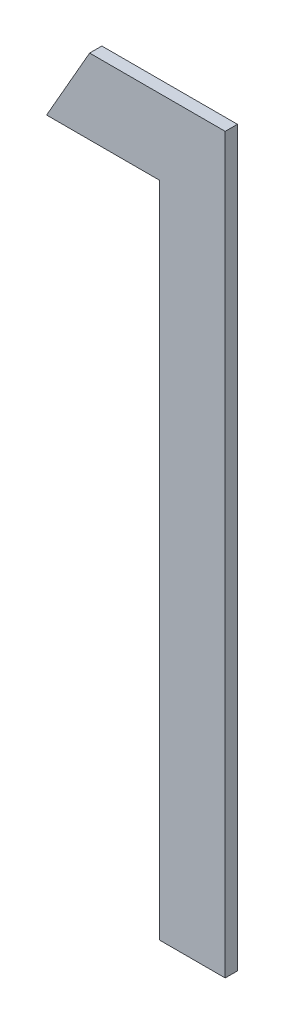
ISO-10303-21;
HEADER;
FILE_DESCRIPTION(('STEP AP214'),'2;1');
FILE_NAME('part.step','',(''),(''),'','','');
FILE_SCHEMA(('AUTOMOTIVE_DESIGN { 1 0 10303 214 1 1 1 1 }'));
ENDSEC;
DATA;
#1=APPLICATION_CONTEXT('core data for automotive mechanical design processes');
#2=APPLICATION_PROTOCOL_DEFINITION('international standard','automotive_design',2000,#1);
#3=PRODUCT_CONTEXT('',#1,'mechanical');
#4=PRODUCT('Part','Part','',(#3));
#5=PRODUCT_RELATED_PRODUCT_CATEGORY('part','',(#4));
#6=PRODUCT_DEFINITION_FORMATION('','',#4);
#7=PRODUCT_DEFINITION_CONTEXT('part definition',#1,'design');
#8=PRODUCT_DEFINITION('design','',#6,#7);
#9=PRODUCT_DEFINITION_SHAPE('','',#8);
#10=(LENGTH_UNIT() NAMED_UNIT(*) SI_UNIT(.MILLI.,.METRE.));
#11=(NAMED_UNIT(*) PLANE_ANGLE_UNIT() SI_UNIT($,.RADIAN.));
#12=(NAMED_UNIT(*) SI_UNIT($,.STERADIAN.) SOLID_ANGLE_UNIT());
#13=UNCERTAINTY_MEASURE_WITH_UNIT(LENGTH_MEASURE(1.E-05),#10,'distance_accuracy_value','');
#14=(GEOMETRIC_REPRESENTATION_CONTEXT(3) GLOBAL_UNCERTAINTY_ASSIGNED_CONTEXT((#13)) GLOBAL_UNIT_ASSIGNED_CONTEXT((#10,
#11,#12)) REPRESENTATION_CONTEXT('',''));
#15=CARTESIAN_POINT('',(0.,0.,0.));
#16=DIRECTION('',(0.,0.,1.));
#17=DIRECTION('',(1.,0.,0.));
#18=AXIS2_PLACEMENT_3D('',#15,#16,#17);
#19=CARTESIAN_POINT('',(1.28230769230769,0.24390475768074,0.551));
#20=DIRECTION('',(-0.86793001385971,0.496686511837681,0.));
#21=DIRECTION('',(-0.496686511837681,-0.86793001385971,0.));
#22=AXIS2_PLACEMENT_3D('',#19,#20,#21);
#23=PLANE('',#22);
#24=DIRECTION('',(0.496686511837677,0.867930013859713,0.));
#25=VECTOR('',#24,1.);
#26=CARTESIAN_POINT('',(1.28230769230769,0.24390475768074,0.55));
#27=LINE('',#26,#25);
#28=CARTESIAN_POINT('',(1.28230769230769,0.24390475768074,0.55));
#29=VERTEX_POINT('',#28);
#30=CARTESIAN_POINT('',(1.28582932692308,0.250058603834586,0.55));
#31=VERTEX_POINT('',#30);
#32=EDGE_CURVE('E11',#29,#31,#27,.T.);
#33=ORIENTED_EDGE('',*,*,#32,.F.);
#34=DIRECTION('',(0.,0.,-1.));
#35=VECTOR('',#34,1.);
#36=CARTESIAN_POINT('',(1.28230769230769,0.24390475768074,0.551));
#37=LINE('',#36,#35);
#38=CARTESIAN_POINT('',(1.28230769230769,0.24390475768074,0.551));
#39=VERTEX_POINT('',#38);
#40=EDGE_CURVE('E119',#39,#29,#37,.T.);
#41=ORIENTED_EDGE('',*,*,#40,.F.);
#42=DIRECTION('',(0.496686511837677,0.867930013859713,0.));
#43=VECTOR('',#42,1.);
#44=CARTESIAN_POINT('',(1.28230769230769,0.24390475768074,0.551));
#45=LINE('',#44,#43);
#46=CARTESIAN_POINT('',(1.28582932692308,0.250058603834586,0.551));
#47=VERTEX_POINT('',#46);
#48=EDGE_CURVE('E112',#39,#47,#45,.T.);
#49=ORIENTED_EDGE('',*,*,#48,.T.);
#50=DIRECTION('',(0.,0.,-1.));
#51=VECTOR('',#50,1.);
#52=CARTESIAN_POINT('',(1.28582932692308,0.250058603834586,0.551));
#53=LINE('',#52,#51);
#54=EDGE_CURVE('E85',#47,#31,#53,.T.);
#55=ORIENTED_EDGE('',*,*,#54,.T.);
#56=EDGE_LOOP('',(#33,#41,#49,#55));
#57=FACE_BOUND('',#56,.T.);
#58=ADVANCED_FACE('F17',(#57),#23,.T.);
#59=CARTESIAN_POINT('',(1.29153846153846,0.24390475768074,0.551));
#60=DIRECTION('',(0.,-1.,0.));
#61=DIRECTION('',(0.,0.,-1.));
#62=AXIS2_PLACEMENT_3D('',#59,#60,#61);
#63=PLANE('',#62);
#64=DIRECTION('',(-1.,0.,0.));
#65=VECTOR('',#64,1.);
#66=CARTESIAN_POINT('',(1.29153846153846,0.24390475768074,0.55));
#67=LINE('',#66,#65);
#68=CARTESIAN_POINT('',(1.29153846153846,0.24390475768074,0.55));
#69=VERTEX_POINT('',#68);
#70=EDGE_CURVE('E24',#69,#29,#67,.T.);
#71=ORIENTED_EDGE('',*,*,#70,.F.);
#72=DIRECTION('',(0.,0.,-1.));
#73=VECTOR('',#72,1.);
#74=CARTESIAN_POINT('',(1.29153846153846,0.24390475768074,0.551));
#75=LINE('',#74,#73);
#76=CARTESIAN_POINT('',(1.29153846153846,0.24390475768074,0.551));
#77=VERTEX_POINT('',#76);
#78=EDGE_CURVE('E114',#77,#69,#75,.T.);
#79=ORIENTED_EDGE('',*,*,#78,.F.);
#80=DIRECTION('',(-1.,0.,0.));
#81=VECTOR('',#80,1.);
#82=CARTESIAN_POINT('',(1.29153846153846,0.24390475768074,0.551));
#83=LINE('',#82,#81);
#84=EDGE_CURVE('E103',#77,#39,#83,.T.);
#85=ORIENTED_EDGE('',*,*,#84,.T.);
#86=ORIENTED_EDGE('',*,*,#40,.T.);
#87=EDGE_LOOP('',(#71,#79,#85,#86));
#88=FACE_BOUND('',#87,.T.);
#89=ADVANCED_FACE('F127',(#88),#63,.T.);
#90=CARTESIAN_POINT('',(1.29153846153846,0.190058603834586,0.551));
#91=DIRECTION('',(-1.,0.,0.));
#92=DIRECTION('',(0.,0.,1.));
#93=AXIS2_PLACEMENT_3D('',#90,#91,#92);
#94=PLANE('',#93);
#95=DIRECTION('',(0.,1.,0.));
#96=VECTOR('',#95,1.);
#97=CARTESIAN_POINT('',(1.29153846153846,0.190058603834586,0.55));
#98=LINE('',#97,#96);
#99=CARTESIAN_POINT('',(1.29153846153846,0.190058603834586,0.55));
#100=VERTEX_POINT('',#99);
#101=EDGE_CURVE('E116',#100,#69,#98,.T.);
#102=ORIENTED_EDGE('',*,*,#101,.F.);
#103=DIRECTION('',(0.,0.,-1.));
#104=VECTOR('',#103,1.);
#105=CARTESIAN_POINT('',(1.29153846153846,0.190058603834586,0.551));
#106=LINE('',#105,#104);
#107=CARTESIAN_POINT('',(1.29153846153846,0.190058603834586,0.551));
#108=VERTEX_POINT('',#107);
#109=EDGE_CURVE('E106',#108,#100,#106,.T.);
#110=ORIENTED_EDGE('',*,*,#109,.F.);
#111=DIRECTION('',(0.,1.,0.));
#112=VECTOR('',#111,1.);
#113=CARTESIAN_POINT('',(1.29153846153846,0.190058603834586,0.551));
#114=LINE('',#113,#112);
#115=EDGE_CURVE('E96',#108,#77,#114,.T.);
#116=ORIENTED_EDGE('',*,*,#115,.T.);
#117=ORIENTED_EDGE('',*,*,#78,.T.);
#118=EDGE_LOOP('',(#102,#110,#116,#117));
#119=FACE_BOUND('',#118,.T.);
#120=ADVANCED_FACE('F123',(#119),#94,.T.);
#121=CARTESIAN_POINT('',(1.29692307692308,0.190058603834586,0.551));
#122=DIRECTION('',(0.,-1.,0.));
#123=DIRECTION('',(0.,0.,-1.));
#124=AXIS2_PLACEMENT_3D('',#121,#122,#123);
#125=PLANE('',#124);
#126=DIRECTION('',(-1.,0.,0.));
#127=VECTOR('',#126,1.);
#128=CARTESIAN_POINT('',(1.29692307692308,0.190058603834586,0.55));
#129=LINE('',#128,#127);
#130=CARTESIAN_POINT('',(1.29692307692308,0.190058603834586,0.55));
#131=VERTEX_POINT('',#130);
#132=EDGE_CURVE('E109',#131,#100,#129,.T.);
#133=ORIENTED_EDGE('',*,*,#132,.F.);
#134=DIRECTION('',(0.,0.,-1.));
#135=VECTOR('',#134,1.);
#136=CARTESIAN_POINT('',(1.29692307692308,0.190058603834586,0.551));
#137=LINE('',#136,#135);
#138=CARTESIAN_POINT('',(1.29692307692308,0.190058603834586,0.551));
#139=VERTEX_POINT('',#138);
#140=EDGE_CURVE('E99',#139,#131,#137,.T.);
#141=ORIENTED_EDGE('',*,*,#140,.F.);
#142=DIRECTION('',(-1.,0.,0.));
#143=VECTOR('',#142,1.);
#144=CARTESIAN_POINT('',(1.29692307692308,0.190058603834586,0.551));
#145=LINE('',#144,#143);
#146=EDGE_CURVE('E79',#139,#108,#145,.T.);
#147=ORIENTED_EDGE('',*,*,#146,.T.);
#148=ORIENTED_EDGE('',*,*,#109,.T.);
#149=EDGE_LOOP('',(#133,#141,#147,#148));
#150=FACE_BOUND('',#149,.T.);
#151=ADVANCED_FACE('F125',(#150),#125,.T.);
#152=CARTESIAN_POINT('',(1.29692307692308,0.250058603834586,0.551));
#153=DIRECTION('',(1.,0.,0.));
#154=DIRECTION('',(0.,0.,-1.));
#155=AXIS2_PLACEMENT_3D('',#152,#153,#154);
#156=PLANE('',#155);
#157=DIRECTION('',(0.,-1.,0.));
#158=VECTOR('',#157,1.);
#159=CARTESIAN_POINT('',(1.29692307692308,0.250058603834586,0.55));
#160=LINE('',#159,#158);
#161=CARTESIAN_POINT('',(1.29692307692308,0.250058603834586,0.55));
#162=VERTEX_POINT('',#161);
#163=EDGE_CURVE('E74',#162,#131,#160,.T.);
#164=ORIENTED_EDGE('',*,*,#163,.F.);
#165=DIRECTION('',(0.,0.,-1.));
#166=VECTOR('',#165,1.);
#167=CARTESIAN_POINT('',(1.29692307692308,0.250058603834586,0.551));
#168=LINE('',#167,#166);
#169=CARTESIAN_POINT('',(1.29692307692308,0.250058603834586,0.551));
#170=VERTEX_POINT('',#169);
#171=EDGE_CURVE('E66',#170,#162,#168,.T.);
#172=ORIENTED_EDGE('',*,*,#171,.F.);
#173=DIRECTION('',(0.,-1.,0.));
#174=VECTOR('',#173,1.);
#175=CARTESIAN_POINT('',(1.29692307692308,0.250058603834586,0.551));
#176=LINE('',#175,#174);
#177=EDGE_CURVE('E71',#170,#139,#176,.T.);
#178=ORIENTED_EDGE('',*,*,#177,.T.);
#179=ORIENTED_EDGE('',*,*,#140,.T.);
#180=EDGE_LOOP('',(#164,#172,#178,#179));
#181=FACE_BOUND('',#180,.T.);
#182=ADVANCED_FACE('F68',(#181),#156,.T.);
#183=CARTESIAN_POINT('',(1.28582932692308,0.250058603834586,0.551));
#184=DIRECTION('',(0.,1.,0.));
#185=DIRECTION('',(0.,0.,1.));
#186=AXIS2_PLACEMENT_3D('',#183,#184,#185);
#187=PLANE('',#186);
#188=DIRECTION('',(1.,0.,0.));
#189=VECTOR('',#188,1.);
#190=CARTESIAN_POINT('',(1.28582932692308,0.250058603834586,0.55));
#191=LINE('',#190,#189);
#192=EDGE_CURVE('E78',#31,#162,#191,.T.);
#193=ORIENTED_EDGE('',*,*,#192,.F.);
#194=ORIENTED_EDGE('',*,*,#54,.F.);
#195=DIRECTION('',(1.,0.,0.));
#196=VECTOR('',#195,1.);
#197=CARTESIAN_POINT('',(1.28582932692308,0.250058603834586,0.551));
#198=LINE('',#197,#196);
#199=EDGE_CURVE('E83',#47,#170,#198,.T.);
#200=ORIENTED_EDGE('',*,*,#199,.T.);
#201=ORIENTED_EDGE('',*,*,#171,.T.);
#202=EDGE_LOOP('',(#193,#194,#200,#201));
#203=FACE_BOUND('',#202,.T.);
#204=ADVANCED_FACE('F84',(#203),#187,.T.);
#205=CARTESIAN_POINT('',(0.,0.,0.551));
#206=DIRECTION('',(0.,0.,-1.));
#207=DIRECTION('',(-1.,0.,0.));
#208=AXIS2_PLACEMENT_3D('',#205,#206,#207);
#209=PLANE('',#208);
#210=ORIENTED_EDGE('',*,*,#48,.F.);
#211=ORIENTED_EDGE('',*,*,#84,.F.);
#212=ORIENTED_EDGE('',*,*,#115,.F.);
#213=ORIENTED_EDGE('',*,*,#146,.F.);
#214=ORIENTED_EDGE('',*,*,#177,.F.);
#215=ORIENTED_EDGE('',*,*,#199,.F.);
#216=EDGE_LOOP('',(#210,#211,#212,#213,#214,#215));
#217=FACE_BOUND('',#216,.T.);
#218=ADVANCED_FACE('F89',(#217),#209,.F.);
#219=CARTESIAN_POINT('',(0.,0.,0.55));
#220=DIRECTION('',(0.,0.,-1.));
#221=DIRECTION('',(-1.,0.,0.));
#222=AXIS2_PLACEMENT_3D('',#219,#220,#221);
#223=PLANE('',#222);
#224=ORIENTED_EDGE('',*,*,#32,.T.);
#225=ORIENTED_EDGE('',*,*,#192,.T.);
#226=ORIENTED_EDGE('',*,*,#163,.T.);
#227=ORIENTED_EDGE('',*,*,#132,.T.);
#228=ORIENTED_EDGE('',*,*,#101,.T.);
#229=ORIENTED_EDGE('',*,*,#70,.T.);
#230=EDGE_LOOP('',(#224,#225,#226,#227,#228,#229));
#231=FACE_BOUND('',#230,.T.);
#232=ADVANCED_FACE('F121',(#231),#223,.T.);
#233=CLOSED_SHELL('',(#58,#89,#120,#151,#182,#204,#218,#232));
#234=MANIFOLD_SOLID_BREP('B1',#233);
#235=ADVANCED_BREP_SHAPE_REPRESENTATION('',(#18,#234),#14);
#236=SHAPE_DEFINITION_REPRESENTATION(#9,#235);
ENDSEC;
END-ISO-10303-21;
